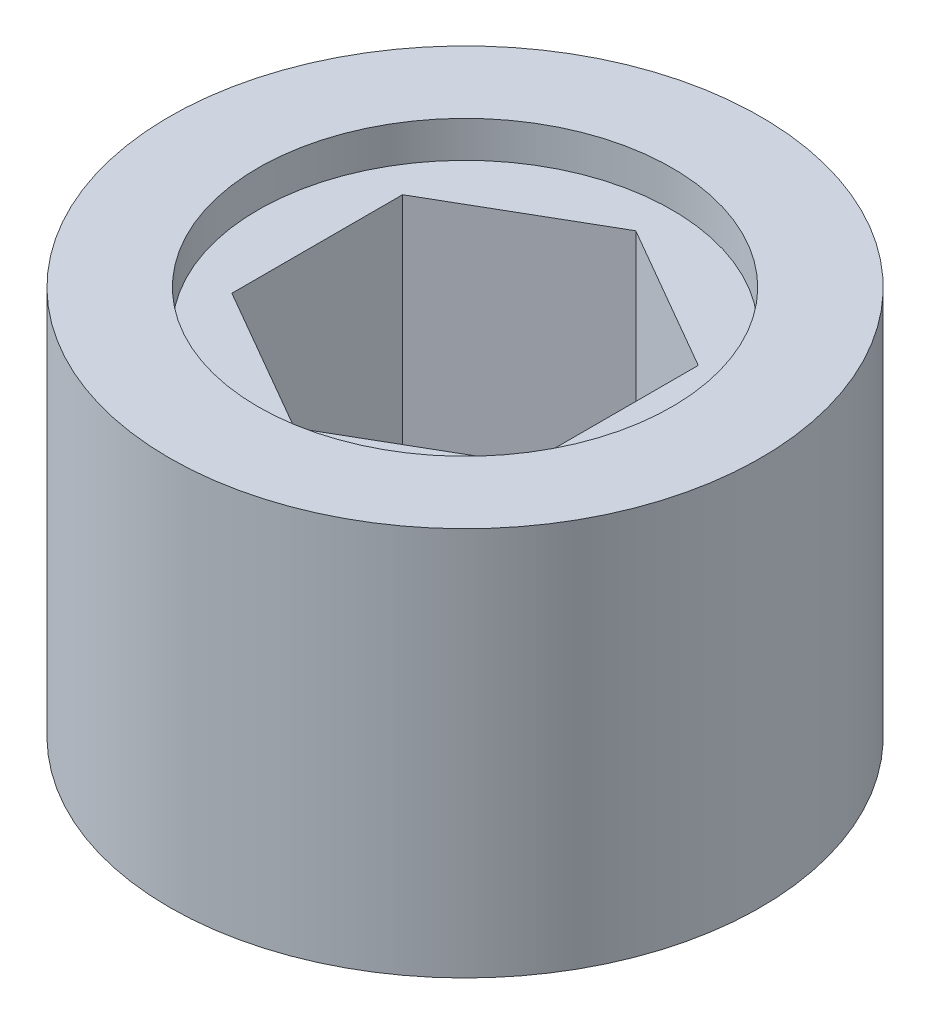
ISO-10303-21;
HEADER;
FILE_DESCRIPTION(('STEP AP214'),'2;1');
FILE_NAME('part.step','',(''),(''),'','','');
FILE_SCHEMA(('AUTOMOTIVE_DESIGN { 1 0 10303 214 1 1 1 1 }'));
ENDSEC;
DATA;
#1=APPLICATION_CONTEXT('core data for automotive mechanical design processes');
#2=APPLICATION_PROTOCOL_DEFINITION('international standard','automotive_design',2000,#1);
#3=PRODUCT_CONTEXT('',#1,'mechanical');
#4=PRODUCT('Part','Part','',(#3));
#5=PRODUCT_RELATED_PRODUCT_CATEGORY('part','',(#4));
#6=PRODUCT_DEFINITION_FORMATION('','',#4);
#7=PRODUCT_DEFINITION_CONTEXT('part definition',#1,'design');
#8=PRODUCT_DEFINITION('design','',#6,#7);
#9=PRODUCT_DEFINITION_SHAPE('','',#8);
#10=(LENGTH_UNIT() NAMED_UNIT(*) SI_UNIT(.MILLI.,.METRE.));
#11=(NAMED_UNIT(*) PLANE_ANGLE_UNIT() SI_UNIT($,.RADIAN.));
#12=(NAMED_UNIT(*) SI_UNIT($,.STERADIAN.) SOLID_ANGLE_UNIT());
#13=UNCERTAINTY_MEASURE_WITH_UNIT(LENGTH_MEASURE(1.E-05),#10,'distance_accuracy_value','');
#14=(GEOMETRIC_REPRESENTATION_CONTEXT(3) GLOBAL_UNCERTAINTY_ASSIGNED_CONTEXT((#13)) GLOBAL_UNIT_ASSIGNED_CONTEXT((#10,
#11,#12)) REPRESENTATION_CONTEXT('',''));
#15=CARTESIAN_POINT('',(0.,0.,0.));
#16=DIRECTION('',(0.,0.,1.));
#17=DIRECTION('',(1.,0.,0.));
#18=AXIS2_PLACEMENT_3D('',#15,#16,#17);
#19=CARTESIAN_POINT('',(0.,16.7132,0.));
#20=DIRECTION('',(0.,-1.,0.));
#21=DIRECTION('',(0.,0.,-1.));
#22=AXIS2_PLACEMENT_3D('',#19,#20,#21);
#23=CYLINDRICAL_SURFACE('',#22,8.89);
#24=CARTESIAN_POINT('',(0.,15.1511,0.));
#25=DIRECTION('',(0.,1.,0.));
#26=DIRECTION('',(0.,0.,1.));
#27=AXIS2_PLACEMENT_3D('',#24,#25,#26);
#28=CIRCLE('',#27,8.89);
#29=CARTESIAN_POINT('',(0.,15.1511,8.89));
#30=VERTEX_POINT('',#29);
#31=EDGE_CURVE('E11',#30,#30,#28,.T.);
#32=ORIENTED_EDGE('',*,*,#31,.F.);
#33=EDGE_LOOP('',(#32));
#34=FACE_BOUND('',#33,.T.);
#35=CARTESIAN_POINT('',(0.,16.7132,0.));
#36=DIRECTION('',(0.,1.,0.));
#37=DIRECTION('',(0.,0.,1.));
#38=AXIS2_PLACEMENT_3D('',#35,#36,#37);
#39=CIRCLE('',#38,8.89);
#40=CARTESIAN_POINT('',(0.,16.7132,8.89));
#41=VERTEX_POINT('',#40);
#42=EDGE_CURVE('E142',#41,#41,#39,.T.);
#43=ORIENTED_EDGE('',*,*,#42,.T.);
#44=EDGE_LOOP('',(#43));
#45=FACE_BOUND('',#44,.T.);
#46=ADVANCED_FACE('F36',(#34,#45),#23,.F.);
#47=CARTESIAN_POINT('',(0.,16.7132,0.));
#48=DIRECTION('',(0.,-1.,0.));
#49=DIRECTION('',(0.,0.,-1.));
#50=AXIS2_PLACEMENT_3D('',#47,#48,#49);
#51=CYLINDRICAL_SURFACE('',#50,12.7);
#52=CARTESIAN_POINT('',(0.,16.7132,0.));
#53=DIRECTION('',(0.,1.,0.));
#54=DIRECTION('',(0.,0.,1.));
#55=AXIS2_PLACEMENT_3D('',#52,#53,#54);
#56=CIRCLE('',#55,12.7);
#57=CARTESIAN_POINT('',(0.,16.7132,12.7));
#58=VERTEX_POINT('',#57);
#59=EDGE_CURVE('E44',#58,#58,#56,.T.);
#60=ORIENTED_EDGE('',*,*,#59,.F.);
#61=EDGE_LOOP('',(#60));
#62=FACE_BOUND('',#61,.T.);
#63=CARTESIAN_POINT('',(0.,0.,0.));
#64=DIRECTION('',(0.,1.,0.));
#65=DIRECTION('',(0.,0.,1.));
#66=AXIS2_PLACEMENT_3D('',#63,#64,#65);
#67=CIRCLE('',#66,12.7);
#68=CARTESIAN_POINT('',(0.,0.,12.7));
#69=VERTEX_POINT('',#68);
#70=EDGE_CURVE('E141',#69,#69,#67,.T.);
#71=ORIENTED_EDGE('',*,*,#70,.T.);
#72=EDGE_LOOP('',(#71));
#73=FACE_BOUND('',#72,.T.);
#74=ADVANCED_FACE('F149',(#62,#73),#51,.T.);
#75=CARTESIAN_POINT('',(0.,16.7132,0.));
#76=DIRECTION('',(0.,1.,0.));
#77=DIRECTION('',(0.,0.,1.));
#78=AXIS2_PLACEMENT_3D('',#75,#76,#77);
#79=PLANE('',#78);
#80=ORIENTED_EDGE('',*,*,#42,.F.);
#81=EDGE_LOOP('',(#80));
#82=FACE_BOUND('',#81,.T.);
#83=ORIENTED_EDGE('',*,*,#59,.T.);
#84=EDGE_LOOP('',(#83));
#85=FACE_BOUND('',#84,.T.);
#86=ADVANCED_FACE('F155',(#82,#85),#79,.T.);
#87=CARTESIAN_POINT('',(0.,0.,0.));
#88=DIRECTION('',(0.,1.,0.));
#89=DIRECTION('',(0.,0.,1.));
#90=AXIS2_PLACEMENT_3D('',#87,#88,#89);
#91=PLANE('',#90);
#92=ORIENTED_EDGE('',*,*,#70,.F.);
#93=EDGE_LOOP('',(#92));
#94=FACE_BOUND('',#93,.T.);
#95=DIRECTION('',(0.,0.,-1.));
#96=VECTOR('',#95,1.);
#97=CARTESIAN_POINT('',(6.35,0.,0.));
#98=LINE('',#97,#96);
#99=CARTESIAN_POINT('',(6.35,0.,3.66617420935412));
#100=VERTEX_POINT('',#99);
#101=CARTESIAN_POINT('',(6.35,0.,-3.66617420935413));
#102=VERTEX_POINT('',#101);
#103=EDGE_CURVE('E120',#100,#102,#98,.T.);
#104=ORIENTED_EDGE('',*,*,#103,.T.);
#105=DIRECTION('',(-0.866025403784439,0.,-0.5));
#106=VECTOR('',#105,1.);
#107=CARTESIAN_POINT('',(3.175,0.,-5.49926131403119));
#108=LINE('',#107,#106);
#109=CARTESIAN_POINT('',(0.,0.,-7.33234841870825));
#110=VERTEX_POINT('',#109);
#111=EDGE_CURVE('E131',#102,#110,#108,.T.);
#112=ORIENTED_EDGE('',*,*,#111,.T.);
#113=DIRECTION('',(-0.866025403784439,0.,0.5));
#114=VECTOR('',#113,1.);
#115=CARTESIAN_POINT('',(-3.175,0.,-5.49926131403119));
#116=LINE('',#115,#114);
#117=CARTESIAN_POINT('',(-6.35,0.,-3.66617420935412));
#118=VERTEX_POINT('',#117);
#119=EDGE_CURVE('E129',#110,#118,#116,.T.);
#120=ORIENTED_EDGE('',*,*,#119,.T.);
#121=DIRECTION('',(0.,0.,1.));
#122=VECTOR('',#121,1.);
#123=CARTESIAN_POINT('',(-6.35,0.,0.));
#124=LINE('',#123,#122);
#125=CARTESIAN_POINT('',(-6.35,0.,3.66617420935412));
#126=VERTEX_POINT('',#125);
#127=EDGE_CURVE('E97',#118,#126,#124,.T.);
#128=ORIENTED_EDGE('',*,*,#127,.T.);
#129=DIRECTION('',(0.866025403784438,0.,0.5));
#130=VECTOR('',#129,1.);
#131=CARTESIAN_POINT('',(-3.175,0.,5.49926131403119));
#132=LINE('',#131,#130);
#133=CARTESIAN_POINT('',(0.,0.,7.33234841870825));
#134=VERTEX_POINT('',#133);
#135=EDGE_CURVE('E125',#126,#134,#132,.T.);
#136=ORIENTED_EDGE('',*,*,#135,.T.);
#137=DIRECTION('',(0.866025403784438,0.,-0.5));
#138=VECTOR('',#137,1.);
#139=CARTESIAN_POINT('',(3.175,0.,5.49926131403118));
#140=LINE('',#139,#138);
#141=EDGE_CURVE('E122',#134,#100,#140,.T.);
#142=ORIENTED_EDGE('',*,*,#141,.T.);
#143=EDGE_LOOP('',(#104,#112,#120,#128,#136,#142));
#144=FACE_BOUND('',#143,.T.);
#145=ADVANCED_FACE('F151',(#94,#144),#91,.F.);
#146=CARTESIAN_POINT('',(6.35,15.1511,0.));
#147=DIRECTION('',(-1.,0.,0.));
#148=DIRECTION('',(0.,0.,1.));
#149=AXIS2_PLACEMENT_3D('',#146,#147,#148);
#150=PLANE('',#149);
#151=ORIENTED_EDGE('',*,*,#103,.F.);
#152=DIRECTION('',(0.,-1.,0.));
#153=VECTOR('',#152,1.);
#154=CARTESIAN_POINT('',(6.35,15.1511,3.66617420935412));
#155=LINE('',#154,#153);
#156=CARTESIAN_POINT('',(6.35,15.1511,3.66617420935412));
#157=VERTEX_POINT('',#156);
#158=EDGE_CURVE('E81',#157,#100,#155,.T.);
#159=ORIENTED_EDGE('',*,*,#158,.F.);
#160=DIRECTION('',(0.,0.,-1.));
#161=VECTOR('',#160,1.);
#162=CARTESIAN_POINT('',(6.35,15.1511,0.));
#163=LINE('',#162,#161);
#164=CARTESIAN_POINT('',(6.35,15.1511,-3.66617420935413));
#165=VERTEX_POINT('',#164);
#166=EDGE_CURVE('E134',#157,#165,#163,.T.);
#167=ORIENTED_EDGE('',*,*,#166,.T.);
#168=DIRECTION('',(0.,-1.,0.));
#169=VECTOR('',#168,1.);
#170=CARTESIAN_POINT('',(6.35,15.1511,-3.66617420935413));
#171=LINE('',#170,#169);
#172=EDGE_CURVE('E52',#165,#102,#171,.T.);
#173=ORIENTED_EDGE('',*,*,#172,.T.);
#174=EDGE_LOOP('',(#151,#159,#167,#173));
#175=FACE_BOUND('',#174,.T.);
#176=ADVANCED_FACE('F154',(#175),#150,.T.);
#177=CARTESIAN_POINT('',(3.175,15.1511,5.49926131403118));
#178=DIRECTION('',(-0.5,0.,-0.866025403784438));
#179=DIRECTION('',(-0.866025403784438,0.,0.5));
#180=AXIS2_PLACEMENT_3D('',#177,#178,#179);
#181=PLANE('',#180);
#182=ORIENTED_EDGE('',*,*,#141,.F.);
#183=DIRECTION('',(0.,-1.,0.));
#184=VECTOR('',#183,1.);
#185=CARTESIAN_POINT('',(0.,15.1511,7.33234841870825));
#186=LINE('',#185,#184);
#187=CARTESIAN_POINT('',(0.,15.1511,7.33234841870825));
#188=VERTEX_POINT('',#187);
#189=EDGE_CURVE('E138',#188,#134,#186,.T.);
#190=ORIENTED_EDGE('',*,*,#189,.F.);
#191=DIRECTION('',(0.866025403784438,0.,-0.5));
#192=VECTOR('',#191,1.);
#193=CARTESIAN_POINT('',(3.175,15.1511,5.49926131403118));
#194=LINE('',#193,#192);
#195=EDGE_CURVE('E260',#188,#157,#194,.T.);
#196=ORIENTED_EDGE('',*,*,#195,.T.);
#197=ORIENTED_EDGE('',*,*,#158,.T.);
#198=EDGE_LOOP('',(#182,#190,#196,#197));
#199=FACE_BOUND('',#198,.T.);
#200=ADVANCED_FACE('F186',(#199),#181,.T.);
#201=CARTESIAN_POINT('',(-3.175,15.1511,5.49926131403119));
#202=DIRECTION('',(0.5,0.,-0.866025403784438));
#203=DIRECTION('',(-0.866025403784438,0.,-0.5));
#204=AXIS2_PLACEMENT_3D('',#201,#202,#203);
#205=PLANE('',#204);
#206=ORIENTED_EDGE('',*,*,#135,.F.);
#207=DIRECTION('',(0.,-1.,0.));
#208=VECTOR('',#207,1.);
#209=CARTESIAN_POINT('',(-6.35,15.1511,3.66617420935412));
#210=LINE('',#209,#208);
#211=CARTESIAN_POINT('',(-6.35,15.1511,3.66617420935412));
#212=VERTEX_POINT('',#211);
#213=EDGE_CURVE('E101',#212,#126,#210,.T.);
#214=ORIENTED_EDGE('',*,*,#213,.F.);
#215=DIRECTION('',(0.866025403784438,0.,0.5));
#216=VECTOR('',#215,1.);
#217=CARTESIAN_POINT('',(-3.175,15.1511,5.49926131403119));
#218=LINE('',#217,#216);
#219=EDGE_CURVE('E112',#212,#188,#218,.T.);
#220=ORIENTED_EDGE('',*,*,#219,.T.);
#221=ORIENTED_EDGE('',*,*,#189,.T.);
#222=EDGE_LOOP('',(#206,#214,#220,#221));
#223=FACE_BOUND('',#222,.T.);
#224=ADVANCED_FACE('F189',(#223),#205,.T.);
#225=CARTESIAN_POINT('',(-6.35,15.1511,0.));
#226=DIRECTION('',(1.,0.,0.));
#227=DIRECTION('',(0.,0.,-1.));
#228=AXIS2_PLACEMENT_3D('',#225,#226,#227);
#229=PLANE('',#228);
#230=ORIENTED_EDGE('',*,*,#127,.F.);
#231=DIRECTION('',(0.,-1.,0.));
#232=VECTOR('',#231,1.);
#233=CARTESIAN_POINT('',(-6.35,15.1511,-3.66617420935412));
#234=LINE('',#233,#232);
#235=CARTESIAN_POINT('',(-6.35,15.1511,-3.66617420935412));
#236=VERTEX_POINT('',#235);
#237=EDGE_CURVE('E92',#236,#118,#234,.T.);
#238=ORIENTED_EDGE('',*,*,#237,.F.);
#239=DIRECTION('',(0.,0.,1.));
#240=VECTOR('',#239,1.);
#241=CARTESIAN_POINT('',(-6.35,15.1511,0.));
#242=LINE('',#241,#240);
#243=EDGE_CURVE('E95',#236,#212,#242,.T.);
#244=ORIENTED_EDGE('',*,*,#243,.T.);
#245=ORIENTED_EDGE('',*,*,#213,.T.);
#246=EDGE_LOOP('',(#230,#238,#244,#245));
#247=FACE_BOUND('',#246,.T.);
#248=ADVANCED_FACE('F94',(#247),#229,.T.);
#249=CARTESIAN_POINT('',(-3.175,15.1511,-5.49926131403119));
#250=DIRECTION('',(0.5,0.,0.866025403784439));
#251=DIRECTION('',(0.866025403784439,0.,-0.5));
#252=AXIS2_PLACEMENT_3D('',#249,#250,#251);
#253=PLANE('',#252);
#254=ORIENTED_EDGE('',*,*,#119,.F.);
#255=DIRECTION('',(0.,-1.,0.));
#256=VECTOR('',#255,1.);
#257=CARTESIAN_POINT('',(0.,15.1511,-7.33234841870825));
#258=LINE('',#257,#256);
#259=CARTESIAN_POINT('',(0.,15.1511,-7.33234841870825));
#260=VERTEX_POINT('',#259);
#261=EDGE_CURVE('E72',#260,#110,#258,.T.);
#262=ORIENTED_EDGE('',*,*,#261,.F.);
#263=DIRECTION('',(-0.866025403784439,0.,0.5));
#264=VECTOR('',#263,1.);
#265=CARTESIAN_POINT('',(-3.175,15.1511,-5.49926131403119));
#266=LINE('',#265,#264);
#267=EDGE_CURVE('E109',#260,#236,#266,.T.);
#268=ORIENTED_EDGE('',*,*,#267,.T.);
#269=ORIENTED_EDGE('',*,*,#237,.T.);
#270=EDGE_LOOP('',(#254,#262,#268,#269));
#271=FACE_BOUND('',#270,.T.);
#272=ADVANCED_FACE('F114',(#271),#253,.T.);
#273=CARTESIAN_POINT('',(3.175,15.1511,-5.49926131403119));
#274=DIRECTION('',(-0.5,0.,0.866025403784438));
#275=DIRECTION('',(0.866025403784439,0.,0.5));
#276=AXIS2_PLACEMENT_3D('',#273,#274,#275);
#277=PLANE('',#276);
#278=ORIENTED_EDGE('',*,*,#111,.F.);
#279=ORIENTED_EDGE('',*,*,#172,.F.);
#280=DIRECTION('',(-0.866025403784439,0.,-0.5));
#281=VECTOR('',#280,1.);
#282=CARTESIAN_POINT('',(3.175,15.1511,-5.49926131403119));
#283=LINE('',#282,#281);
#284=EDGE_CURVE('E115',#165,#260,#283,.T.);
#285=ORIENTED_EDGE('',*,*,#284,.T.);
#286=ORIENTED_EDGE('',*,*,#261,.T.);
#287=EDGE_LOOP('',(#278,#279,#285,#286));
#288=FACE_BOUND('',#287,.T.);
#289=ADVANCED_FACE('F158',(#288),#277,.T.);
#290=CARTESIAN_POINT('',(0.,15.1511,0.));
#291=DIRECTION('',(0.,1.,0.));
#292=DIRECTION('',(0.,0.,1.));
#293=AXIS2_PLACEMENT_3D('',#290,#291,#292);
#294=PLANE('',#293);
#295=ORIENTED_EDGE('',*,*,#166,.F.);
#296=ORIENTED_EDGE('',*,*,#195,.F.);
#297=ORIENTED_EDGE('',*,*,#219,.F.);
#298=ORIENTED_EDGE('',*,*,#243,.F.);
#299=ORIENTED_EDGE('',*,*,#267,.F.);
#300=ORIENTED_EDGE('',*,*,#284,.F.);
#301=EDGE_LOOP('',(#295,#296,#297,#298,#299,#300));
#302=FACE_BOUND('',#301,.T.);
#303=ORIENTED_EDGE('',*,*,#31,.T.);
#304=EDGE_LOOP('',(#303));
#305=FACE_BOUND('',#304,.T.);
#306=ADVANCED_FACE('F106',(#302,#305),#294,.T.);
#307=CLOSED_SHELL('',(#46,#74,#86,#145,#176,#200,#224,#248,#272,#289,#306));
#308=MANIFOLD_SOLID_BREP('B2',#307);
#309=ADVANCED_BREP_SHAPE_REPRESENTATION('',(#18,#308),#14);
#310=SHAPE_DEFINITION_REPRESENTATION(#9,#309);
ENDSEC;
END-ISO-10303-21;
